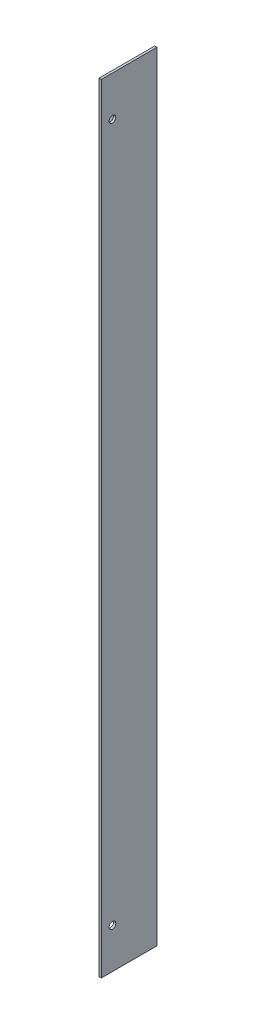
ISO-10303-21;
HEADER;
FILE_DESCRIPTION(('STEP AP214'),'2;1');
FILE_NAME('part.step','',(''),(''),'','','');
FILE_SCHEMA(('AUTOMOTIVE_DESIGN { 1 0 10303 214 1 1 1 1 }'));
ENDSEC;
DATA;
#1=APPLICATION_CONTEXT('core data for automotive mechanical design processes');
#2=APPLICATION_PROTOCOL_DEFINITION('international standard','automotive_design',2000,#1);
#3=PRODUCT_CONTEXT('',#1,'mechanical');
#4=PRODUCT('Part','Part','',(#3));
#5=PRODUCT_RELATED_PRODUCT_CATEGORY('part','',(#4));
#6=PRODUCT_DEFINITION_FORMATION('','',#4);
#7=PRODUCT_DEFINITION_CONTEXT('part definition',#1,'design');
#8=PRODUCT_DEFINITION('design','',#6,#7);
#9=PRODUCT_DEFINITION_SHAPE('','',#8);
#10=(LENGTH_UNIT() NAMED_UNIT(*) SI_UNIT(.MILLI.,.METRE.));
#11=(NAMED_UNIT(*) PLANE_ANGLE_UNIT() SI_UNIT($,.RADIAN.));
#12=(NAMED_UNIT(*) SI_UNIT($,.STERADIAN.) SOLID_ANGLE_UNIT());
#13=UNCERTAINTY_MEASURE_WITH_UNIT(LENGTH_MEASURE(1.E-05),#10,'distance_accuracy_value','');
#14=(GEOMETRIC_REPRESENTATION_CONTEXT(3) GLOBAL_UNCERTAINTY_ASSIGNED_CONTEXT((#13)) GLOBAL_UNIT_ASSIGNED_CONTEXT((#10,
#11,#12)) REPRESENTATION_CONTEXT('',''));
#15=CARTESIAN_POINT('',(0.,0.,0.));
#16=DIRECTION('',(0.,0.,1.));
#17=DIRECTION('',(1.,0.,0.));
#18=AXIS2_PLACEMENT_3D('',#15,#16,#17);
#19=CARTESIAN_POINT('',(-55.4417853066137,61.1803752262789,25.));
#20=DIRECTION('',(1.,0.,0.));
#21=DIRECTION('',(0.,1.,0.));
#22=AXIS2_PLACEMENT_3D('',#19,#20,#21);
#23=PLANE('',#22);
#24=CARTESIAN_POINT('',(-55.4417853066137,43.1803752262789,20.));
#25=DIRECTION('',(1.,0.,0.));
#26=DIRECTION('',(0.,1.,0.));
#27=AXIS2_PLACEMENT_3D('',#24,#25,#26);
#28=CIRCLE('',#27,1.5);
#29=CARTESIAN_POINT('',(-55.4417853066137,44.6803752262789,20.));
#30=VERTEX_POINT('',#29);
#31=EDGE_CURVE('E149',#30,#30,#28,.T.);
#32=ORIENTED_EDGE('',*,*,#31,.T.);
#33=EDGE_LOOP('',(#32));
#34=FACE_BOUND('',#33,.T.);
#35=CARTESIAN_POINT('',(-55.4417853066137,-270.819624773721,20.));
#36=DIRECTION('',(1.,0.,0.));
#37=DIRECTION('',(0.,1.,0.));
#38=AXIS2_PLACEMENT_3D('',#35,#36,#37);
#39=CIRCLE('',#38,1.5);
#40=CARTESIAN_POINT('',(-55.4417853066137,-269.319624773721,20.));
#41=VERTEX_POINT('',#40);
#42=EDGE_CURVE('E140',#41,#41,#39,.T.);
#43=ORIENTED_EDGE('',*,*,#42,.T.);
#44=EDGE_LOOP('',(#43));
#45=FACE_BOUND('',#44,.T.);
#46=DIRECTION('',(0.,1.,0.));
#47=VECTOR('',#46,1.);
#48=CARTESIAN_POINT('',(-55.4417853066131,61.1803752262784,1.));
#49=LINE('',#48,#47);
#50=CARTESIAN_POINT('',(-55.4417853066137,-288.819624773721,1.));
#51=VERTEX_POINT('',#50);
#52=CARTESIAN_POINT('',(-55.4417853066131,61.1803752262784,1.));
#53=VERTEX_POINT('',#52);
#54=EDGE_CURVE('E48',#51,#53,#49,.T.);
#55=ORIENTED_EDGE('',*,*,#54,.F.);
#56=DIRECTION('',(0.,0.,-1.));
#57=VECTOR('',#56,1.);
#58=CARTESIAN_POINT('',(-55.4417853066137,-288.819624773721,25.));
#59=LINE('',#58,#57);
#60=CARTESIAN_POINT('',(-55.4417853066137,-288.819624773721,25.));
#61=VERTEX_POINT('',#60);
#62=EDGE_CURVE('E11',#61,#51,#59,.T.);
#63=ORIENTED_EDGE('',*,*,#62,.F.);
#64=DIRECTION('',(0.,-1.,0.));
#65=VECTOR('',#64,1.);
#66=CARTESIAN_POINT('',(-55.4417853066137,61.1803752262789,25.));
#67=LINE('',#66,#65);
#68=CARTESIAN_POINT('',(-55.4417853066137,61.1803752262789,25.));
#69=VERTEX_POINT('',#68);
#70=EDGE_CURVE('E101',#69,#61,#67,.T.);
#71=ORIENTED_EDGE('',*,*,#70,.F.);
#72=DIRECTION('',(0.,0.,-1.));
#73=VECTOR('',#72,1.);
#74=CARTESIAN_POINT('',(-55.4417853066137,61.1803752262789,25.));
#75=LINE('',#74,#73);
#76=EDGE_CURVE('E100',#69,#53,#75,.T.);
#77=ORIENTED_EDGE('',*,*,#76,.T.);
#78=EDGE_LOOP('',(#55,#63,#71,#77));
#79=FACE_BOUND('',#78,.T.);
#80=ADVANCED_FACE('F32',(#34,#45,#79),#23,.F.);
#81=CARTESIAN_POINT('',(-55.4417853066137,-288.819624773721,25.));
#82=DIRECTION('',(0.,1.,0.));
#83=DIRECTION('',(0.,0.,1.));
#84=AXIS2_PLACEMENT_3D('',#81,#82,#83);
#85=PLANE('',#84);
#86=DIRECTION('',(1.,0.,0.));
#87=VECTOR('',#86,1.);
#88=CARTESIAN_POINT('',(-55.4417853066137,-288.819624773721,0.));
#89=LINE('',#88,#87);
#90=CARTESIAN_POINT('',(-55.4417853066137,-288.819624773721,0.));
#91=VERTEX_POINT('',#90);
#92=CARTESIAN_POINT('',(-54.4417853066137,-288.819624773721,0.));
#93=VERTEX_POINT('',#92);
#94=EDGE_CURVE('E152',#91,#93,#89,.T.);
#95=ORIENTED_EDGE('',*,*,#94,.T.);
#96=DIRECTION('',(0.,0.,-1.));
#97=VECTOR('',#96,1.);
#98=CARTESIAN_POINT('',(-54.4417853066137,-288.819624773721,25.));
#99=LINE('',#98,#97);
#100=CARTESIAN_POINT('',(-54.4417853066137,-288.819624773721,25.));
#101=VERTEX_POINT('',#100);
#102=EDGE_CURVE('E40',#101,#93,#99,.T.);
#103=ORIENTED_EDGE('',*,*,#102,.F.);
#104=DIRECTION('',(1.,0.,0.));
#105=VECTOR('',#104,1.);
#106=CARTESIAN_POINT('',(-55.4417853066137,-288.819624773721,25.));
#107=LINE('',#106,#105);
#108=EDGE_CURVE('E85',#61,#101,#107,.T.);
#109=ORIENTED_EDGE('',*,*,#108,.F.);
#110=ORIENTED_EDGE('',*,*,#62,.T.);
#111=DIRECTION('',(0.,0.,-1.));
#112=VECTOR('',#111,1.);
#113=CARTESIAN_POINT('',(-55.4417853066131,-288.819624773722,1.));
#114=LINE('',#113,#112);
#115=EDGE_CURVE('E109',#51,#91,#114,.T.);
#116=ORIENTED_EDGE('',*,*,#115,.T.);
#117=EDGE_LOOP('',(#95,#103,#109,#110,#116));
#118=FACE_BOUND('',#117,.T.);
#119=ADVANCED_FACE('F205',(#118),#85,.F.);
#120=CARTESIAN_POINT('',(-54.4417853066137,61.1803752262789,25.));
#121=DIRECTION('',(-1.,0.,0.));
#122=DIRECTION('',(0.,-1.,0.));
#123=AXIS2_PLACEMENT_3D('',#120,#121,#122);
#124=PLANE('',#123);
#125=CARTESIAN_POINT('',(-54.4417853066137,-270.819624773721,20.));
#126=DIRECTION('',(1.,0.,0.));
#127=DIRECTION('',(0.,1.,0.));
#128=AXIS2_PLACEMENT_3D('',#125,#126,#127);
#129=CIRCLE('',#128,1.5);
#130=CARTESIAN_POINT('',(-54.4417853066137,-269.319624773721,20.));
#131=VERTEX_POINT('',#130);
#132=EDGE_CURVE('E137',#131,#131,#129,.T.);
#133=ORIENTED_EDGE('',*,*,#132,.F.);
#134=EDGE_LOOP('',(#133));
#135=FACE_BOUND('',#134,.T.);
#136=CARTESIAN_POINT('',(-54.4417853066137,43.1803752262789,20.));
#137=DIRECTION('',(1.,0.,0.));
#138=DIRECTION('',(0.,1.,0.));
#139=AXIS2_PLACEMENT_3D('',#136,#137,#138);
#140=CIRCLE('',#139,1.5);
#141=CARTESIAN_POINT('',(-54.4417853066137,44.6803752262789,20.));
#142=VERTEX_POINT('',#141);
#143=EDGE_CURVE('E145',#142,#142,#140,.T.);
#144=ORIENTED_EDGE('',*,*,#143,.F.);
#145=EDGE_LOOP('',(#144));
#146=FACE_BOUND('',#145,.T.);
#147=DIRECTION('',(0.,1.,0.));
#148=VECTOR('',#147,1.);
#149=CARTESIAN_POINT('',(-54.4417853066137,61.1803752262789,0.));
#150=LINE('',#149,#148);
#151=CARTESIAN_POINT('',(-54.4417853066137,61.1803752262789,0.));
#152=VERTEX_POINT('',#151);
#153=EDGE_CURVE('E161',#93,#152,#150,.T.);
#154=ORIENTED_EDGE('',*,*,#153,.T.);
#155=DIRECTION('',(0.,0.,-1.));
#156=VECTOR('',#155,1.);
#157=CARTESIAN_POINT('',(-54.4417853066137,61.1803752262789,25.));
#158=LINE('',#157,#156);
#159=CARTESIAN_POINT('',(-54.4417853066137,61.1803752262789,25.));
#160=VERTEX_POINT('',#159);
#161=EDGE_CURVE('E102',#160,#152,#158,.T.);
#162=ORIENTED_EDGE('',*,*,#161,.F.);
#163=DIRECTION('',(0.,1.,0.));
#164=VECTOR('',#163,1.);
#165=CARTESIAN_POINT('',(-54.4417853066137,61.1803752262789,25.));
#166=LINE('',#165,#164);
#167=EDGE_CURVE('E157',#101,#160,#166,.T.);
#168=ORIENTED_EDGE('',*,*,#167,.F.);
#169=ORIENTED_EDGE('',*,*,#102,.T.);
#170=EDGE_LOOP('',(#154,#162,#168,#169));
#171=FACE_BOUND('',#170,.T.);
#172=ADVANCED_FACE('F210',(#135,#146,#171),#124,.F.);
#173=CARTESIAN_POINT('',(-55.4417853066137,61.1803752262789,25.));
#174=DIRECTION('',(0.,-1.,0.));
#175=DIRECTION('',(0.,0.,-1.));
#176=AXIS2_PLACEMENT_3D('',#173,#174,#175);
#177=PLANE('',#176);
#178=DIRECTION('',(-1.,0.,0.));
#179=VECTOR('',#178,1.);
#180=CARTESIAN_POINT('',(-55.4417853066137,61.1803752262789,0.));
#181=LINE('',#180,#179);
#182=CARTESIAN_POINT('',(-55.4417853066137,61.1803752262789,0.));
#183=VERTEX_POINT('',#182);
#184=EDGE_CURVE('E78',#152,#183,#181,.T.);
#185=ORIENTED_EDGE('',*,*,#184,.T.);
#186=DIRECTION('',(0.,0.,-1.));
#187=VECTOR('',#186,1.);
#188=CARTESIAN_POINT('',(-55.4417853066131,61.1803752262784,1.));
#189=LINE('',#188,#187);
#190=EDGE_CURVE('E104',#53,#183,#189,.T.);
#191=ORIENTED_EDGE('',*,*,#190,.F.);
#192=ORIENTED_EDGE('',*,*,#76,.F.);
#193=DIRECTION('',(-1.,0.,0.));
#194=VECTOR('',#193,1.);
#195=CARTESIAN_POINT('',(-55.4417853066137,61.1803752262789,25.));
#196=LINE('',#195,#194);
#197=EDGE_CURVE('E56',#160,#69,#196,.T.);
#198=ORIENTED_EDGE('',*,*,#197,.F.);
#199=ORIENTED_EDGE('',*,*,#161,.T.);
#200=EDGE_LOOP('',(#185,#191,#192,#198,#199));
#201=FACE_BOUND('',#200,.T.);
#202=ADVANCED_FACE('F105',(#201),#177,.F.);
#203=CARTESIAN_POINT('',(0.,0.,25.));
#204=DIRECTION('',(0.,0.,1.));
#205=DIRECTION('',(1.,0.,0.));
#206=AXIS2_PLACEMENT_3D('',#203,#204,#205);
#207=PLANE('',#206);
#208=ORIENTED_EDGE('',*,*,#70,.T.);
#209=ORIENTED_EDGE('',*,*,#108,.T.);
#210=ORIENTED_EDGE('',*,*,#167,.T.);
#211=ORIENTED_EDGE('',*,*,#197,.T.);
#212=EDGE_LOOP('',(#208,#209,#210,#211));
#213=FACE_BOUND('',#212,.T.);
#214=ADVANCED_FACE('F223',(#213),#207,.T.);
#215=CARTESIAN_POINT('',(0.,0.,0.));
#216=DIRECTION('',(0.,0.,1.));
#217=DIRECTION('',(1.,0.,0.));
#218=AXIS2_PLACEMENT_3D('',#215,#216,#217);
#219=PLANE('',#218);
#220=ORIENTED_EDGE('',*,*,#94,.F.);
#221=DIRECTION('',(0.707106781186544,-0.707106781186551,0.));
#222=VECTOR('',#221,1.);
#223=CARTESIAN_POINT('',(-55.4417853066131,-288.819624773722,0.));
#224=LINE('',#223,#222);
#225=CARTESIAN_POINT('',(-79.4417853066137,-264.819624773721,0.));
#226=VERTEX_POINT('',#225);
#227=EDGE_CURVE('E174',#226,#91,#224,.T.);
#228=ORIENTED_EDGE('',*,*,#227,.F.);
#229=DIRECTION('',(0.,-1.,0.));
#230=VECTOR('',#229,1.);
#231=CARTESIAN_POINT('',(-79.4417853066137,-264.819624773721,0.));
#232=LINE('',#231,#230);
#233=CARTESIAN_POINT('',(-79.4417853066137,37.1803752262788,0.));
#234=VERTEX_POINT('',#233);
#235=EDGE_CURVE('E135',#234,#226,#232,.T.);
#236=ORIENTED_EDGE('',*,*,#235,.F.);
#237=DIRECTION('',(-0.707106781186561,-0.707106781186535,0.));
#238=VECTOR('',#237,1.);
#239=CARTESIAN_POINT('',(-55.4417853066131,61.1803752262784,0.));
#240=LINE('',#239,#238);
#241=EDGE_CURVE('E177',#183,#234,#240,.T.);
#242=ORIENTED_EDGE('',*,*,#241,.F.);
#243=ORIENTED_EDGE('',*,*,#184,.F.);
#244=ORIENTED_EDGE('',*,*,#153,.F.);
#245=EDGE_LOOP('',(#220,#228,#236,#242,#243,#244));
#246=FACE_BOUND('',#245,.T.);
#247=CARTESIAN_POINT('',(-74.4417853066137,21.1803752262789,0.));
#248=DIRECTION('',(0.,0.,1.));
#249=DIRECTION('',(1.,0.,0.));
#250=AXIS2_PLACEMENT_3D('',#247,#248,#249);
#251=CIRCLE('',#250,1.5);
#252=CARTESIAN_POINT('',(-72.9417853066137,21.1803752262789,0.));
#253=VERTEX_POINT('',#252);
#254=EDGE_CURVE('E171',#253,#253,#251,.T.);
#255=ORIENTED_EDGE('',*,*,#254,.T.);
#256=EDGE_LOOP('',(#255));
#257=FACE_BOUND('',#256,.T.);
#258=CARTESIAN_POINT('',(-74.4417853066137,-168.819624773722,0.));
#259=DIRECTION('',(0.,0.,1.));
#260=DIRECTION('',(1.,0.,0.));
#261=AXIS2_PLACEMENT_3D('',#258,#259,#260);
#262=CIRCLE('',#261,1.5);
#263=CARTESIAN_POINT('',(-72.9417853066137,-168.819624773722,0.));
#264=VERTEX_POINT('',#263);
#265=EDGE_CURVE('E349',#264,#264,#262,.T.);
#266=ORIENTED_EDGE('',*,*,#265,.T.);
#267=EDGE_LOOP('',(#266));
#268=FACE_BOUND('',#267,.T.);
#269=CARTESIAN_POINT('',(-74.4417853066137,-248.819624773721,0.));
#270=DIRECTION('',(0.,0.,1.));
#271=DIRECTION('',(1.,0.,0.));
#272=AXIS2_PLACEMENT_3D('',#269,#270,#271);
#273=CIRCLE('',#272,1.5);
#274=CARTESIAN_POINT('',(-72.9417853066137,-248.819624773721,0.));
#275=VERTEX_POINT('',#274);
#276=EDGE_CURVE('E346',#275,#275,#273,.T.);
#277=ORIENTED_EDGE('',*,*,#276,.T.);
#278=EDGE_LOOP('',(#277));
#279=FACE_BOUND('',#278,.T.);
#280=ADVANCED_FACE('F188',(#246,#257,#268,#279),#219,.F.);
#281=CARTESIAN_POINT('',(-55.4417853066137,43.1803752262789,20.));
#282=DIRECTION('',(1.,0.,0.));
#283=DIRECTION('',(0.,1.,0.));
#284=AXIS2_PLACEMENT_3D('',#281,#282,#283);
#285=CYLINDRICAL_SURFACE('',#284,1.5);
#286=ORIENTED_EDGE('',*,*,#31,.F.);
#287=EDGE_LOOP('',(#286));
#288=FACE_BOUND('',#287,.T.);
#289=ORIENTED_EDGE('',*,*,#143,.T.);
#290=EDGE_LOOP('',(#289));
#291=FACE_BOUND('',#290,.T.);
#292=ADVANCED_FACE('F216',(#288,#291),#285,.F.);
#293=CARTESIAN_POINT('',(-55.4417853066137,-270.819624773721,20.));
#294=DIRECTION('',(1.,0.,0.));
#295=DIRECTION('',(0.,1.,0.));
#296=AXIS2_PLACEMENT_3D('',#293,#294,#295);
#297=CYLINDRICAL_SURFACE('',#296,1.5);
#298=ORIENTED_EDGE('',*,*,#42,.F.);
#299=EDGE_LOOP('',(#298));
#300=FACE_BOUND('',#299,.T.);
#301=ORIENTED_EDGE('',*,*,#132,.T.);
#302=EDGE_LOOP('',(#301));
#303=FACE_BOUND('',#302,.T.);
#304=ADVANCED_FACE('F200',(#300,#303),#297,.F.);
#305=CARTESIAN_POINT('',(0.,0.,1.));
#306=DIRECTION('',(0.,0.,1.));
#307=DIRECTION('',(1.,0.,0.));
#308=AXIS2_PLACEMENT_3D('',#305,#306,#307);
#309=PLANE('',#308);
#310=CARTESIAN_POINT('',(-74.4417853066137,-168.819624773722,1.));
#311=DIRECTION('',(0.,0.,1.));
#312=DIRECTION('',(1.,0.,0.));
#313=AXIS2_PLACEMENT_3D('',#310,#311,#312);
#314=CIRCLE('',#313,1.5);
#315=CARTESIAN_POINT('',(-72.9417853066137,-168.819624773722,1.));
#316=VERTEX_POINT('',#315);
#317=EDGE_CURVE('E352',#316,#316,#314,.T.);
#318=ORIENTED_EDGE('',*,*,#317,.F.);
#319=EDGE_LOOP('',(#318));
#320=FACE_BOUND('',#319,.T.);
#321=DIRECTION('',(0.707106781186544,-0.707106781186551,0.));
#322=VECTOR('',#321,1.);
#323=CARTESIAN_POINT('',(-55.4417853066131,-288.819624773722,1.));
#324=LINE('',#323,#322);
#325=CARTESIAN_POINT('',(-79.4417853066137,-264.819624773721,1.));
#326=VERTEX_POINT('',#325);
#327=EDGE_CURVE('E119',#326,#51,#324,.T.);
#328=ORIENTED_EDGE('',*,*,#327,.T.);
#329=ORIENTED_EDGE('',*,*,#54,.T.);
#330=DIRECTION('',(-0.707106781186561,-0.707106781186535,0.));
#331=VECTOR('',#330,1.);
#332=CARTESIAN_POINT('',(-55.4417853066131,61.1803752262784,1.));
#333=LINE('',#332,#331);
#334=CARTESIAN_POINT('',(-79.4417853066137,37.1803752262788,1.));
#335=VERTEX_POINT('',#334);
#336=EDGE_CURVE('E116',#53,#335,#333,.T.);
#337=ORIENTED_EDGE('',*,*,#336,.T.);
#338=DIRECTION('',(0.,-1.,0.));
#339=VECTOR('',#338,1.);
#340=CARTESIAN_POINT('',(-79.4417853066137,-264.819624773721,1.));
#341=LINE('',#340,#339);
#342=EDGE_CURVE('E125',#335,#326,#341,.T.);
#343=ORIENTED_EDGE('',*,*,#342,.T.);
#344=EDGE_LOOP('',(#328,#329,#337,#343));
#345=FACE_BOUND('',#344,.T.);
#346=CARTESIAN_POINT('',(-74.4417853066137,21.1803752262789,1.));
#347=DIRECTION('',(0.,0.,1.));
#348=DIRECTION('',(1.,0.,0.));
#349=AXIS2_PLACEMENT_3D('',#346,#347,#348);
#350=CIRCLE('',#349,1.5);
#351=CARTESIAN_POINT('',(-72.9417853066137,21.1803752262789,1.));
#352=VERTEX_POINT('',#351);
#353=EDGE_CURVE('E178',#352,#352,#350,.T.);
#354=ORIENTED_EDGE('',*,*,#353,.F.);
#355=EDGE_LOOP('',(#354));
#356=FACE_BOUND('',#355,.T.);
#357=CARTESIAN_POINT('',(-74.4417853066137,-248.819624773721,1.));
#358=DIRECTION('',(0.,0.,1.));
#359=DIRECTION('',(1.,0.,0.));
#360=AXIS2_PLACEMENT_3D('',#357,#358,#359);
#361=CIRCLE('',#360,1.5);
#362=CARTESIAN_POINT('',(-72.9417853066137,-248.819624773721,1.));
#363=VERTEX_POINT('',#362);
#364=EDGE_CURVE('E343',#363,#363,#361,.T.);
#365=ORIENTED_EDGE('',*,*,#364,.F.);
#366=EDGE_LOOP('',(#365));
#367=FACE_BOUND('',#366,.T.);
#368=ADVANCED_FACE('F114',(#320,#345,#356,#367),#309,.T.);
#369=CARTESIAN_POINT('',(-55.4417853066131,-288.819624773722,1.));
#370=DIRECTION('',(0.707106781186551,0.707106781186544,0.));
#371=DIRECTION('',(-0.707106781186544,0.707106781186551,0.));
#372=AXIS2_PLACEMENT_3D('',#369,#370,#371);
#373=PLANE('',#372);
#374=ORIENTED_EDGE('',*,*,#227,.T.);
#375=ORIENTED_EDGE('',*,*,#115,.F.);
#376=ORIENTED_EDGE('',*,*,#327,.F.);
#377=DIRECTION('',(0.,0.,-1.));
#378=VECTOR('',#377,1.);
#379=CARTESIAN_POINT('',(-79.4417853066137,-264.819624773721,1.));
#380=LINE('',#379,#378);
#381=EDGE_CURVE('E127',#326,#226,#380,.T.);
#382=ORIENTED_EDGE('',*,*,#381,.T.);
#383=EDGE_LOOP('',(#374,#375,#376,#382));
#384=FACE_BOUND('',#383,.T.);
#385=ADVANCED_FACE('F192',(#384),#373,.F.);
#386=CARTESIAN_POINT('',(-55.4417853066131,61.1803752262784,1.));
#387=DIRECTION('',(0.707106781186535,-0.707106781186561,0.));
#388=DIRECTION('',(0.707106781186561,0.707106781186535,0.));
#389=AXIS2_PLACEMENT_3D('',#386,#387,#388);
#390=PLANE('',#389);
#391=ORIENTED_EDGE('',*,*,#241,.T.);
#392=DIRECTION('',(0.,0.,-1.));
#393=VECTOR('',#392,1.);
#394=CARTESIAN_POINT('',(-79.4417853066137,37.1803752262788,1.));
#395=LINE('',#394,#393);
#396=EDGE_CURVE('E110',#335,#234,#395,.T.);
#397=ORIENTED_EDGE('',*,*,#396,.F.);
#398=ORIENTED_EDGE('',*,*,#336,.F.);
#399=ORIENTED_EDGE('',*,*,#190,.T.);
#400=EDGE_LOOP('',(#391,#397,#398,#399));
#401=FACE_BOUND('',#400,.T.);
#402=ADVANCED_FACE('F122',(#401),#390,.F.);
#403=CARTESIAN_POINT('',(-79.4417853066137,-264.819624773721,1.));
#404=DIRECTION('',(1.,0.,0.));
#405=DIRECTION('',(0.,0.,-1.));
#406=AXIS2_PLACEMENT_3D('',#403,#404,#405);
#407=PLANE('',#406);
#408=ORIENTED_EDGE('',*,*,#235,.T.);
#409=ORIENTED_EDGE('',*,*,#381,.F.);
#410=ORIENTED_EDGE('',*,*,#342,.F.);
#411=ORIENTED_EDGE('',*,*,#396,.T.);
#412=EDGE_LOOP('',(#408,#409,#410,#411));
#413=FACE_BOUND('',#412,.T.);
#414=ADVANCED_FACE('F184',(#413),#407,.F.);
#415=CARTESIAN_POINT('',(-74.4417853066137,21.1803752262789,1.));
#416=DIRECTION('',(0.,0.,-1.));
#417=DIRECTION('',(-1.,0.,0.));
#418=AXIS2_PLACEMENT_3D('',#415,#416,#417);
#419=CYLINDRICAL_SURFACE('',#418,1.5);
#420=ORIENTED_EDGE('',*,*,#353,.T.);
#421=EDGE_LOOP('',(#420));
#422=FACE_BOUND('',#421,.T.);
#423=ORIENTED_EDGE('',*,*,#254,.F.);
#424=EDGE_LOOP('',(#423));
#425=FACE_BOUND('',#424,.T.);
#426=ADVANCED_FACE('F307',(#422,#425),#419,.F.);
#427=CARTESIAN_POINT('',(-74.4417853066137,-168.819624773722,1.));
#428=DIRECTION('',(0.,0.,-1.));
#429=DIRECTION('',(-1.,0.,0.));
#430=AXIS2_PLACEMENT_3D('',#427,#428,#429);
#431=CYLINDRICAL_SURFACE('',#430,1.5);
#432=ORIENTED_EDGE('',*,*,#317,.T.);
#433=EDGE_LOOP('',(#432));
#434=FACE_BOUND('',#433,.T.);
#435=ORIENTED_EDGE('',*,*,#265,.F.);
#436=EDGE_LOOP('',(#435));
#437=FACE_BOUND('',#436,.T.);
#438=ADVANCED_FACE('F315',(#434,#437),#431,.F.);
#439=CARTESIAN_POINT('',(-74.4417853066137,-248.819624773721,1.));
#440=DIRECTION('',(0.,0.,-1.));
#441=DIRECTION('',(-1.,0.,0.));
#442=AXIS2_PLACEMENT_3D('',#439,#440,#441);
#443=CYLINDRICAL_SURFACE('',#442,1.5);
#444=ORIENTED_EDGE('',*,*,#364,.T.);
#445=EDGE_LOOP('',(#444));
#446=FACE_BOUND('',#445,.T.);
#447=ORIENTED_EDGE('',*,*,#276,.F.);
#448=EDGE_LOOP('',(#447));
#449=FACE_BOUND('',#448,.T.);
#450=ADVANCED_FACE('F324',(#446,#449),#443,.F.);
#451=CLOSED_SHELL('',(#80,#119,#172,#202,#214,#280,#292,#304,#368,#385,#402,#414,#426,#438,#450));
#452=MANIFOLD_SOLID_BREP('B2',#451);
#453=ADVANCED_BREP_SHAPE_REPRESENTATION('',(#18,#452),#14);
#454=SHAPE_DEFINITION_REPRESENTATION(#9,#453);
ENDSEC;
END-ISO-10303-21;
